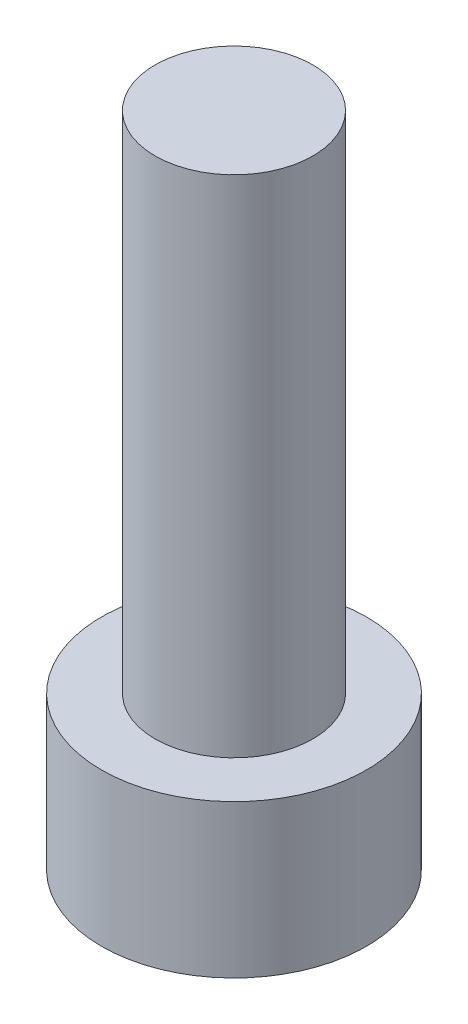
ISO-10303-21;
HEADER;
FILE_DESCRIPTION(('STEP AP214'),'2;1');
FILE_NAME('part.step','',(''),(''),'','','');
FILE_SCHEMA(('AUTOMOTIVE_DESIGN { 1 0 10303 214 1 1 1 1 }'));
ENDSEC;
DATA;
#1=APPLICATION_CONTEXT('core data for automotive mechanical design processes');
#2=APPLICATION_PROTOCOL_DEFINITION('international standard','automotive_design',2000,#1);
#3=PRODUCT_CONTEXT('',#1,'mechanical');
#4=PRODUCT('Part','Part','',(#3));
#5=PRODUCT_RELATED_PRODUCT_CATEGORY('part','',(#4));
#6=PRODUCT_DEFINITION_FORMATION('','',#4);
#7=PRODUCT_DEFINITION_CONTEXT('part definition',#1,'design');
#8=PRODUCT_DEFINITION('design','',#6,#7);
#9=PRODUCT_DEFINITION_SHAPE('','',#8);
#10=(LENGTH_UNIT() NAMED_UNIT(*) SI_UNIT(.MILLI.,.METRE.));
#11=(NAMED_UNIT(*) PLANE_ANGLE_UNIT() SI_UNIT($,.RADIAN.));
#12=(NAMED_UNIT(*) SI_UNIT($,.STERADIAN.) SOLID_ANGLE_UNIT());
#13=UNCERTAINTY_MEASURE_WITH_UNIT(LENGTH_MEASURE(1.E-05),#10,'distance_accuracy_value','');
#14=(GEOMETRIC_REPRESENTATION_CONTEXT(3) GLOBAL_UNCERTAINTY_ASSIGNED_CONTEXT((#13)) GLOBAL_UNIT_ASSIGNED_CONTEXT((#10,
#11,#12)) REPRESENTATION_CONTEXT('',''));
#15=CARTESIAN_POINT('',(0.,0.,0.));
#16=DIRECTION('',(0.,0.,1.));
#17=DIRECTION('',(1.,0.,0.));
#18=AXIS2_PLACEMENT_3D('',#15,#16,#17);
#19=CARTESIAN_POINT('',(0.,4.84,0.));
#20=DIRECTION('',(0.,-1.,0.));
#21=DIRECTION('',(0.,0.,-1.));
#22=AXIS2_PLACEMENT_3D('',#19,#20,#21);
#23=CYLINDRICAL_SURFACE('',#22,4.2);
#24=CARTESIAN_POINT('',(0.,4.84,0.));
#25=DIRECTION('',(0.,1.,0.));
#26=DIRECTION('',(0.,0.,1.));
#27=AXIS2_PLACEMENT_3D('',#24,#25,#26);
#28=CIRCLE('',#27,4.2);
#29=CARTESIAN_POINT('',(0.,4.84,4.2));
#30=VERTEX_POINT('',#29);
#31=EDGE_CURVE('E43',#30,#30,#28,.T.);
#32=ORIENTED_EDGE('',*,*,#31,.F.);
#33=EDGE_LOOP('',(#32));
#34=FACE_BOUND('',#33,.T.);
#35=CARTESIAN_POINT('',(0.,0.,0.));
#36=DIRECTION('',(0.,1.,0.));
#37=DIRECTION('',(0.,0.,1.));
#38=AXIS2_PLACEMENT_3D('',#35,#36,#37);
#39=CIRCLE('',#38,4.2);
#40=CARTESIAN_POINT('',(0.,0.,4.2));
#41=VERTEX_POINT('',#40);
#42=EDGE_CURVE('E38',#41,#41,#39,.T.);
#43=ORIENTED_EDGE('',*,*,#42,.T.);
#44=EDGE_LOOP('',(#43));
#45=FACE_BOUND('',#44,.T.);
#46=ADVANCED_FACE('F35',(#34,#45),#23,.T.);
#47=CARTESIAN_POINT('',(0.,4.84,0.));
#48=DIRECTION('',(0.,1.,0.));
#49=DIRECTION('',(0.,0.,1.));
#50=AXIS2_PLACEMENT_3D('',#47,#48,#49);
#51=PLANE('',#50);
#52=CARTESIAN_POINT('',(0.,4.84,0.));
#53=DIRECTION('',(0.,1.,0.));
#54=DIRECTION('',(0.,0.,1.));
#55=AXIS2_PLACEMENT_3D('',#52,#53,#54);
#56=CIRCLE('',#55,2.5);
#57=CARTESIAN_POINT('',(0.,4.84,2.5));
#58=VERTEX_POINT('',#57);
#59=EDGE_CURVE('E11',#58,#58,#56,.T.);
#60=ORIENTED_EDGE('',*,*,#59,.F.);
#61=EDGE_LOOP('',(#60));
#62=FACE_BOUND('',#61,.T.);
#63=ORIENTED_EDGE('',*,*,#31,.T.);
#64=EDGE_LOOP('',(#63));
#65=FACE_BOUND('',#64,.T.);
#66=ADVANCED_FACE('F155',(#62,#65),#51,.T.);
#67=CARTESIAN_POINT('',(0.,0.,0.));
#68=DIRECTION('',(0.,1.,0.));
#69=DIRECTION('',(0.,0.,1.));
#70=AXIS2_PLACEMENT_3D('',#67,#68,#69);
#71=PLANE('',#70);
#72=DIRECTION('',(-0.5,0.,0.866025403784439));
#73=VECTOR('',#72,1.);
#74=CARTESIAN_POINT('',(2.3,0.,0.));
#75=LINE('',#74,#73);
#76=CARTESIAN_POINT('',(2.3,0.,0.));
#77=VERTEX_POINT('',#76);
#78=CARTESIAN_POINT('',(1.15,0.,1.99185842870421));
#79=VERTEX_POINT('',#78);
#80=EDGE_CURVE('E125',#77,#79,#75,.T.);
#81=ORIENTED_EDGE('',*,*,#80,.F.);
#82=DIRECTION('',(0.5,0.,0.866025403784439));
#83=VECTOR('',#82,1.);
#84=CARTESIAN_POINT('',(1.15,0.,-1.99185842870421));
#85=LINE('',#84,#83);
#86=CARTESIAN_POINT('',(1.15,0.,-1.99185842870421));
#87=VERTEX_POINT('',#86);
#88=EDGE_CURVE('E51',#87,#77,#85,.T.);
#89=ORIENTED_EDGE('',*,*,#88,.F.);
#90=DIRECTION('',(1.,0.,0.));
#91=VECTOR('',#90,1.);
#92=CARTESIAN_POINT('',(-1.15,0.,-1.99185842870421));
#93=LINE('',#92,#91);
#94=CARTESIAN_POINT('',(-1.15,0.,-1.99185842870421));
#95=VERTEX_POINT('',#94);
#96=EDGE_CURVE('E134',#95,#87,#93,.T.);
#97=ORIENTED_EDGE('',*,*,#96,.F.);
#98=DIRECTION('',(0.5,0.,-0.866025403784439));
#99=VECTOR('',#98,1.);
#100=CARTESIAN_POINT('',(-2.3,0.,0.));
#101=LINE('',#100,#99);
#102=CARTESIAN_POINT('',(-2.3,0.,0.));
#103=VERTEX_POINT('',#102);
#104=EDGE_CURVE('E132',#103,#95,#101,.T.);
#105=ORIENTED_EDGE('',*,*,#104,.F.);
#106=DIRECTION('',(-0.5,0.,-0.866025403784439));
#107=VECTOR('',#106,1.);
#108=CARTESIAN_POINT('',(-1.15,0.,1.99185842870421));
#109=LINE('',#108,#107);
#110=CARTESIAN_POINT('',(-1.15,0.,1.99185842870421));
#111=VERTEX_POINT('',#110);
#112=EDGE_CURVE('E99',#111,#103,#109,.T.);
#113=ORIENTED_EDGE('',*,*,#112,.F.);
#114=DIRECTION('',(-1.,0.,0.));
#115=VECTOR('',#114,1.);
#116=CARTESIAN_POINT('',(1.15,0.,1.99185842870421));
#117=LINE('',#116,#115);
#118=EDGE_CURVE('E128',#79,#111,#117,.T.);
#119=ORIENTED_EDGE('',*,*,#118,.F.);
#120=EDGE_LOOP('',(#81,#89,#97,#105,#113,#119));
#121=FACE_BOUND('',#120,.T.);
#122=ORIENTED_EDGE('',*,*,#42,.F.);
#123=EDGE_LOOP('',(#122));
#124=FACE_BOUND('',#123,.T.);
#125=ADVANCED_FACE('F152',(#121,#124),#71,.F.);
#126=CARTESIAN_POINT('',(0.,20.84,0.));
#127=DIRECTION('',(0.,-1.,0.));
#128=DIRECTION('',(0.,0.,-1.));
#129=AXIS2_PLACEMENT_3D('',#126,#127,#128);
#130=CYLINDRICAL_SURFACE('',#129,2.5);
#131=CARTESIAN_POINT('',(0.,20.84,0.));
#132=DIRECTION('',(0.,1.,0.));
#133=DIRECTION('',(0.,0.,1.));
#134=AXIS2_PLACEMENT_3D('',#131,#132,#133);
#135=CIRCLE('',#134,2.5);
#136=CARTESIAN_POINT('',(0.,20.84,2.5));
#137=VERTEX_POINT('',#136);
#138=EDGE_CURVE('E138',#137,#137,#135,.T.);
#139=ORIENTED_EDGE('',*,*,#138,.F.);
#140=EDGE_LOOP('',(#139));
#141=FACE_BOUND('',#140,.T.);
#142=ORIENTED_EDGE('',*,*,#59,.T.);
#143=EDGE_LOOP('',(#142));
#144=FACE_BOUND('',#143,.T.);
#145=ADVANCED_FACE('F154',(#141,#144),#130,.T.);
#146=CARTESIAN_POINT('',(0.,20.84,0.));
#147=DIRECTION('',(0.,1.,0.));
#148=DIRECTION('',(0.,0.,1.));
#149=AXIS2_PLACEMENT_3D('',#146,#147,#148);
#150=PLANE('',#149);
#151=ORIENTED_EDGE('',*,*,#138,.T.);
#152=EDGE_LOOP('',(#151));
#153=FACE_BOUND('',#152,.T.);
#154=ADVANCED_FACE('F161',(#153),#150,.T.);
#155=CARTESIAN_POINT('',(1.15,3.4,-1.99185842870421));
#156=DIRECTION('',(0.866025403784439,0.,-0.5));
#157=DIRECTION('',(-0.5,0.,-0.866025403784439));
#158=AXIS2_PLACEMENT_3D('',#155,#156,#157);
#159=PLANE('',#158);
#160=ORIENTED_EDGE('',*,*,#88,.T.);
#161=DIRECTION('',(0.,-1.,0.));
#162=VECTOR('',#161,1.);
#163=CARTESIAN_POINT('',(2.3,3.4,0.));
#164=LINE('',#163,#162);
#165=CARTESIAN_POINT('',(2.3,3.4,0.));
#166=VERTEX_POINT('',#165);
#167=EDGE_CURVE('E81',#166,#77,#164,.T.);
#168=ORIENTED_EDGE('',*,*,#167,.F.);
#169=DIRECTION('',(0.5,0.,0.866025403784439));
#170=VECTOR('',#169,1.);
#171=CARTESIAN_POINT('',(1.15,3.4,-1.99185842870421));
#172=LINE('',#171,#170);
#173=CARTESIAN_POINT('',(1.15,3.4,-1.99185842870421));
#174=VERTEX_POINT('',#173);
#175=EDGE_CURVE('E136',#174,#166,#172,.T.);
#176=ORIENTED_EDGE('',*,*,#175,.F.);
#177=DIRECTION('',(0.,-1.,0.));
#178=VECTOR('',#177,1.);
#179=CARTESIAN_POINT('',(1.15,3.4,-1.99185842870421));
#180=LINE('',#179,#178);
#181=EDGE_CURVE('E59',#174,#87,#180,.T.);
#182=ORIENTED_EDGE('',*,*,#181,.T.);
#183=EDGE_LOOP('',(#160,#168,#176,#182));
#184=FACE_BOUND('',#183,.T.);
#185=ADVANCED_FACE('F190',(#184),#159,.F.);
#186=CARTESIAN_POINT('',(-1.15,3.4,-1.99185842870421));
#187=DIRECTION('',(0.,0.,-1.));
#188=DIRECTION('',(-1.,0.,0.));
#189=AXIS2_PLACEMENT_3D('',#186,#187,#188);
#190=PLANE('',#189);
#191=ORIENTED_EDGE('',*,*,#96,.T.);
#192=ORIENTED_EDGE('',*,*,#181,.F.);
#193=DIRECTION('',(1.,0.,0.));
#194=VECTOR('',#193,1.);
#195=CARTESIAN_POINT('',(-1.15,3.4,-1.99185842870421));
#196=LINE('',#195,#194);
#197=CARTESIAN_POINT('',(-1.15,3.4,-1.99185842870421));
#198=VERTEX_POINT('',#197);
#199=EDGE_CURVE('E111',#198,#174,#196,.T.);
#200=ORIENTED_EDGE('',*,*,#199,.F.);
#201=DIRECTION('',(0.,-1.,0.));
#202=VECTOR('',#201,1.);
#203=CARTESIAN_POINT('',(-1.15,3.4,-1.99185842870421));
#204=LINE('',#203,#202);
#205=EDGE_CURVE('E103',#198,#95,#204,.T.);
#206=ORIENTED_EDGE('',*,*,#205,.T.);
#207=EDGE_LOOP('',(#191,#192,#200,#206));
#208=FACE_BOUND('',#207,.T.);
#209=ADVANCED_FACE('F204',(#208),#190,.F.);
#210=CARTESIAN_POINT('',(-2.3,3.4,0.));
#211=DIRECTION('',(-0.866025403784439,0.,-0.5));
#212=DIRECTION('',(-0.5,0.,0.866025403784439));
#213=AXIS2_PLACEMENT_3D('',#210,#211,#212);
#214=PLANE('',#213);
#215=ORIENTED_EDGE('',*,*,#104,.T.);
#216=ORIENTED_EDGE('',*,*,#205,.F.);
#217=DIRECTION('',(0.5,0.,-0.866025403784439));
#218=VECTOR('',#217,1.);
#219=CARTESIAN_POINT('',(-2.3,3.4,0.));
#220=LINE('',#219,#218);
#221=CARTESIAN_POINT('',(-2.3,3.4,0.));
#222=VERTEX_POINT('',#221);
#223=EDGE_CURVE('E107',#222,#198,#220,.T.);
#224=ORIENTED_EDGE('',*,*,#223,.F.);
#225=DIRECTION('',(0.,-1.,0.));
#226=VECTOR('',#225,1.);
#227=CARTESIAN_POINT('',(-2.3,3.4,0.));
#228=LINE('',#227,#226);
#229=EDGE_CURVE('E92',#222,#103,#228,.T.);
#230=ORIENTED_EDGE('',*,*,#229,.T.);
#231=EDGE_LOOP('',(#215,#216,#224,#230));
#232=FACE_BOUND('',#231,.T.);
#233=ADVANCED_FACE('F108',(#232),#214,.F.);
#234=CARTESIAN_POINT('',(-1.15,3.4,1.99185842870421));
#235=DIRECTION('',(-0.866025403784439,0.,0.5));
#236=DIRECTION('',(0.5,0.,0.866025403784439));
#237=AXIS2_PLACEMENT_3D('',#234,#235,#236);
#238=PLANE('',#237);
#239=ORIENTED_EDGE('',*,*,#112,.T.);
#240=ORIENTED_EDGE('',*,*,#229,.F.);
#241=DIRECTION('',(-0.5,0.,-0.866025403784439));
#242=VECTOR('',#241,1.);
#243=CARTESIAN_POINT('',(-1.15,3.4,1.99185842870421));
#244=LINE('',#243,#242);
#245=CARTESIAN_POINT('',(-1.15,3.4,1.99185842870421));
#246=VERTEX_POINT('',#245);
#247=EDGE_CURVE('E96',#246,#222,#244,.T.);
#248=ORIENTED_EDGE('',*,*,#247,.F.);
#249=DIRECTION('',(0.,-1.,0.));
#250=VECTOR('',#249,1.);
#251=CARTESIAN_POINT('',(-1.15,3.4,1.99185842870421));
#252=LINE('',#251,#250);
#253=EDGE_CURVE('E104',#246,#111,#252,.T.);
#254=ORIENTED_EDGE('',*,*,#253,.T.);
#255=EDGE_LOOP('',(#239,#240,#248,#254));
#256=FACE_BOUND('',#255,.T.);
#257=ADVANCED_FACE('F94',(#256),#238,.F.);
#258=CARTESIAN_POINT('',(1.15,3.4,1.99185842870421));
#259=DIRECTION('',(0.,0.,1.));
#260=DIRECTION('',(1.,0.,0.));
#261=AXIS2_PLACEMENT_3D('',#258,#259,#260);
#262=PLANE('',#261);
#263=ORIENTED_EDGE('',*,*,#118,.T.);
#264=ORIENTED_EDGE('',*,*,#253,.F.);
#265=DIRECTION('',(-1.,0.,0.));
#266=VECTOR('',#265,1.);
#267=CARTESIAN_POINT('',(1.15,3.4,1.99185842870421));
#268=LINE('',#267,#266);
#269=CARTESIAN_POINT('',(1.15,3.4,1.99185842870421));
#270=VERTEX_POINT('',#269);
#271=EDGE_CURVE('E117',#270,#246,#268,.T.);
#272=ORIENTED_EDGE('',*,*,#271,.F.);
#273=DIRECTION('',(0.,-1.,0.));
#274=VECTOR('',#273,1.);
#275=CARTESIAN_POINT('',(1.15,3.4,1.99185842870421));
#276=LINE('',#275,#274);
#277=EDGE_CURVE('E141',#270,#79,#276,.T.);
#278=ORIENTED_EDGE('',*,*,#277,.T.);
#279=EDGE_LOOP('',(#263,#264,#272,#278));
#280=FACE_BOUND('',#279,.T.);
#281=ADVANCED_FACE('F229',(#280),#262,.F.);
#282=CARTESIAN_POINT('',(2.3,3.4,0.));
#283=DIRECTION('',(0.866025403784439,0.,0.5));
#284=DIRECTION('',(0.5,0.,-0.866025403784439));
#285=AXIS2_PLACEMENT_3D('',#282,#283,#284);
#286=PLANE('',#285);
#287=ORIENTED_EDGE('',*,*,#80,.T.);
#288=ORIENTED_EDGE('',*,*,#277,.F.);
#289=DIRECTION('',(-0.5,0.,0.866025403784439));
#290=VECTOR('',#289,1.);
#291=CARTESIAN_POINT('',(2.3,3.4,0.));
#292=LINE('',#291,#290);
#293=EDGE_CURVE('E119',#166,#270,#292,.T.);
#294=ORIENTED_EDGE('',*,*,#293,.F.);
#295=ORIENTED_EDGE('',*,*,#167,.T.);
#296=EDGE_LOOP('',(#287,#288,#294,#295));
#297=FACE_BOUND('',#296,.T.);
#298=ADVANCED_FACE('F238',(#297),#286,.F.);
#299=CARTESIAN_POINT('',(0.,3.4,0.));
#300=DIRECTION('',(0.,-1.,0.));
#301=DIRECTION('',(0.,0.,-1.));
#302=AXIS2_PLACEMENT_3D('',#299,#300,#301);
#303=PLANE('',#302);
#304=ORIENTED_EDGE('',*,*,#175,.T.);
#305=ORIENTED_EDGE('',*,*,#293,.T.);
#306=ORIENTED_EDGE('',*,*,#271,.T.);
#307=ORIENTED_EDGE('',*,*,#247,.T.);
#308=ORIENTED_EDGE('',*,*,#223,.T.);
#309=ORIENTED_EDGE('',*,*,#199,.T.);
#310=EDGE_LOOP('',(#304,#305,#306,#307,#308,#309));
#311=FACE_BOUND('',#310,.T.);
#312=ADVANCED_FACE('F114',(#311),#303,.T.);
#313=CLOSED_SHELL('',(#46,#66,#125,#145,#154,#185,#209,#233,#257,#281,#298,#312));
#314=MANIFOLD_SOLID_BREP('B2',#313);
#315=ADVANCED_BREP_SHAPE_REPRESENTATION('',(#18,#314),#14);
#316=SHAPE_DEFINITION_REPRESENTATION(#9,#315);
ENDSEC;
END-ISO-10303-21;
